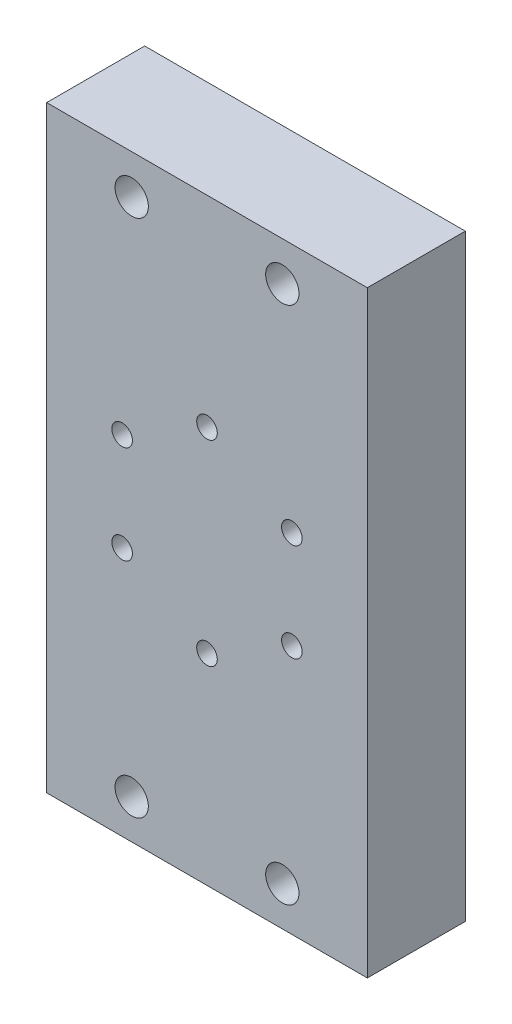
ISO-10303-21;
HEADER;
FILE_DESCRIPTION(('STEP AP214'),'2;1');
FILE_NAME('part.step','',(''),(''),'','','');
FILE_SCHEMA(('AUTOMOTIVE_DESIGN { 1 0 10303 214 1 1 1 1 }'));
ENDSEC;
DATA;
#1=APPLICATION_CONTEXT('core data for automotive mechanical design processes');
#2=APPLICATION_PROTOCOL_DEFINITION('international standard','automotive_design',2000,#1);
#3=PRODUCT_CONTEXT('',#1,'mechanical');
#4=PRODUCT('Part','Part','',(#3));
#5=PRODUCT_RELATED_PRODUCT_CATEGORY('part','',(#4));
#6=PRODUCT_DEFINITION_FORMATION('','',#4);
#7=PRODUCT_DEFINITION_CONTEXT('part definition',#1,'design');
#8=PRODUCT_DEFINITION('design','',#6,#7);
#9=PRODUCT_DEFINITION_SHAPE('','',#8);
#10=(LENGTH_UNIT() NAMED_UNIT(*) SI_UNIT(.MILLI.,.METRE.));
#11=(NAMED_UNIT(*) PLANE_ANGLE_UNIT() SI_UNIT($,.RADIAN.));
#12=(NAMED_UNIT(*) SI_UNIT($,.STERADIAN.) SOLID_ANGLE_UNIT());
#13=UNCERTAINTY_MEASURE_WITH_UNIT(LENGTH_MEASURE(1.E-05),#10,'distance_accuracy_value','');
#14=(GEOMETRIC_REPRESENTATION_CONTEXT(3) GLOBAL_UNCERTAINTY_ASSIGNED_CONTEXT((#13)) GLOBAL_UNIT_ASSIGNED_CONTEXT((#10,
#11,#12)) REPRESENTATION_CONTEXT('',''));
#15=CARTESIAN_POINT('',(0.,0.,0.));
#16=DIRECTION('',(0.,0.,1.));
#17=DIRECTION('',(1.,0.,0.));
#18=AXIS2_PLACEMENT_3D('',#15,#16,#17);
#19=CARTESIAN_POINT('',(0.,0.,20.));
#20=DIRECTION('',(0.,0.,-1.));
#21=DIRECTION('',(-1.,0.,0.));
#22=AXIS2_PLACEMENT_3D('',#19,#20,#21);
#23=PLANE('',#22);
#24=CARTESIAN_POINT('',(15.37,-53.,20.));
#25=DIRECTION('',(0.,0.,1.));
#26=DIRECTION('',(1.,0.,0.));
#27=AXIS2_PLACEMENT_3D('',#24,#25,#26);
#28=CIRCLE('',#27,3.4);
#29=CARTESIAN_POINT('',(18.77,-53.,20.));
#30=VERTEX_POINT('',#29);
#31=EDGE_CURVE('E156',#30,#30,#28,.T.);
#32=ORIENTED_EDGE('',*,*,#31,.F.);
#33=EDGE_LOOP('',(#32));
#34=FACE_BOUND('',#33,.T.);
#35=CARTESIAN_POINT('',(-17.3205080756888,-10.,20.));
#36=DIRECTION('',(0.,0.,1.));
#37=DIRECTION('',(1.,0.,0.));
#38=AXIS2_PLACEMENT_3D('',#35,#36,#37);
#39=CIRCLE('',#38,2.1);
#40=CARTESIAN_POINT('',(-15.2205080756888,-10.,20.));
#41=VERTEX_POINT('',#40);
#42=EDGE_CURVE('E132',#41,#41,#39,.T.);
#43=ORIENTED_EDGE('',*,*,#42,.F.);
#44=EDGE_LOOP('',(#43));
#45=FACE_BOUND('',#44,.T.);
#46=CARTESIAN_POINT('',(17.3205080756888,-10.,20.));
#47=DIRECTION('',(0.,0.,1.));
#48=DIRECTION('',(1.,0.,0.));
#49=AXIS2_PLACEMENT_3D('',#46,#47,#48);
#50=CIRCLE('',#49,2.1);
#51=CARTESIAN_POINT('',(19.4205080756888,-10.,20.));
#52=VERTEX_POINT('',#51);
#53=EDGE_CURVE('E120',#52,#52,#50,.T.);
#54=ORIENTED_EDGE('',*,*,#53,.F.);
#55=EDGE_LOOP('',(#54));
#56=FACE_BOUND('',#55,.T.);
#57=CARTESIAN_POINT('',(17.3205080756888,10.,20.));
#58=DIRECTION('',(0.,0.,1.));
#59=DIRECTION('',(1.,0.,0.));
#60=AXIS2_PLACEMENT_3D('',#57,#58,#59);
#61=CIRCLE('',#60,2.1);
#62=CARTESIAN_POINT('',(19.4205080756888,10.,20.));
#63=VERTEX_POINT('',#62);
#64=EDGE_CURVE('E114',#63,#63,#61,.T.);
#65=ORIENTED_EDGE('',*,*,#64,.F.);
#66=EDGE_LOOP('',(#65));
#67=FACE_BOUND('',#66,.T.);
#68=DIRECTION('',(0.,1.,0.));
#69=VECTOR('',#68,1.);
#70=CARTESIAN_POINT('',(32.72,-61.,20.));
#71=LINE('',#70,#69);
#72=CARTESIAN_POINT('',(32.72,-61.,20.));
#73=VERTEX_POINT('',#72);
#74=CARTESIAN_POINT('',(32.72,61.,20.));
#75=VERTEX_POINT('',#74);
#76=EDGE_CURVE('E86',#73,#75,#71,.T.);
#77=ORIENTED_EDGE('',*,*,#76,.T.);
#78=DIRECTION('',(-1.,0.,0.));
#79=VECTOR('',#78,1.);
#80=CARTESIAN_POINT('',(-32.72,61.,20.));
#81=LINE('',#80,#79);
#82=CARTESIAN_POINT('',(-32.72,61.,20.));
#83=VERTEX_POINT('',#82);
#84=EDGE_CURVE('E81',#75,#83,#81,.T.);
#85=ORIENTED_EDGE('',*,*,#84,.T.);
#86=DIRECTION('',(0.,-1.,0.));
#87=VECTOR('',#86,1.);
#88=CARTESIAN_POINT('',(-32.72,-61.,20.));
#89=LINE('',#88,#87);
#90=CARTESIAN_POINT('',(-32.72,-61.,20.));
#91=VERTEX_POINT('',#90);
#92=EDGE_CURVE('E84',#83,#91,#89,.T.);
#93=ORIENTED_EDGE('',*,*,#92,.T.);
#94=DIRECTION('',(1.,0.,0.));
#95=VECTOR('',#94,1.);
#96=CARTESIAN_POINT('',(-32.72,-61.,20.));
#97=LINE('',#96,#95);
#98=EDGE_CURVE('E51',#91,#73,#97,.T.);
#99=ORIENTED_EDGE('',*,*,#98,.T.);
#100=EDGE_LOOP('',(#77,#85,#93,#99));
#101=FACE_BOUND('',#100,.T.);
#102=CARTESIAN_POINT('',(0.,-20.,20.));
#103=DIRECTION('',(0.,0.,1.));
#104=DIRECTION('',(1.,0.,0.));
#105=AXIS2_PLACEMENT_3D('',#102,#103,#104);
#106=CIRCLE('',#105,2.1);
#107=CARTESIAN_POINT('',(2.1,-20.,20.));
#108=VERTEX_POINT('',#107);
#109=EDGE_CURVE('E126',#108,#108,#106,.T.);
#110=ORIENTED_EDGE('',*,*,#109,.F.);
#111=EDGE_LOOP('',(#110));
#112=FACE_BOUND('',#111,.T.);
#113=CARTESIAN_POINT('',(-17.3205080756888,10.,20.));
#114=DIRECTION('',(0.,0.,1.));
#115=DIRECTION('',(1.,0.,0.));
#116=AXIS2_PLACEMENT_3D('',#113,#114,#115);
#117=CIRCLE('',#116,2.1);
#118=CARTESIAN_POINT('',(-15.2205080756888,10.,20.));
#119=VERTEX_POINT('',#118);
#120=EDGE_CURVE('E138',#119,#119,#117,.T.);
#121=ORIENTED_EDGE('',*,*,#120,.F.);
#122=EDGE_LOOP('',(#121));
#123=FACE_BOUND('',#122,.T.);
#124=CARTESIAN_POINT('',(0.,20.,20.));
#125=DIRECTION('',(0.,0.,1.));
#126=DIRECTION('',(1.,0.,0.));
#127=AXIS2_PLACEMENT_3D('',#124,#125,#126);
#128=CIRCLE('',#127,2.1);
#129=CARTESIAN_POINT('',(2.1,20.,20.));
#130=VERTEX_POINT('',#129);
#131=EDGE_CURVE('E144',#130,#130,#128,.T.);
#132=ORIENTED_EDGE('',*,*,#131,.F.);
#133=EDGE_LOOP('',(#132));
#134=FACE_BOUND('',#133,.T.);
#135=CARTESIAN_POINT('',(-15.37,-53.,20.));
#136=DIRECTION('',(0.,0.,1.));
#137=DIRECTION('',(1.,0.,0.));
#138=AXIS2_PLACEMENT_3D('',#135,#136,#137);
#139=CIRCLE('',#138,3.4);
#140=CARTESIAN_POINT('',(-11.97,-53.,20.));
#141=VERTEX_POINT('',#140);
#142=EDGE_CURVE('E150',#141,#141,#139,.T.);
#143=ORIENTED_EDGE('',*,*,#142,.F.);
#144=EDGE_LOOP('',(#143));
#145=FACE_BOUND('',#144,.T.);
#146=CARTESIAN_POINT('',(15.37,53.,20.));
#147=DIRECTION('',(0.,0.,1.));
#148=DIRECTION('',(1.,0.,0.));
#149=AXIS2_PLACEMENT_3D('',#146,#147,#148);
#150=CIRCLE('',#149,3.4);
#151=CARTESIAN_POINT('',(18.77,53.,20.));
#152=VERTEX_POINT('',#151);
#153=EDGE_CURVE('E162',#152,#152,#150,.T.);
#154=ORIENTED_EDGE('',*,*,#153,.F.);
#155=EDGE_LOOP('',(#154));
#156=FACE_BOUND('',#155,.T.);
#157=CARTESIAN_POINT('',(-15.37,53.,20.));
#158=DIRECTION('',(0.,0.,1.));
#159=DIRECTION('',(1.,0.,0.));
#160=AXIS2_PLACEMENT_3D('',#157,#158,#159);
#161=CIRCLE('',#160,3.4);
#162=CARTESIAN_POINT('',(-11.97,53.,20.));
#163=VERTEX_POINT('',#162);
#164=EDGE_CURVE('E168',#163,#163,#161,.T.);
#165=ORIENTED_EDGE('',*,*,#164,.F.);
#166=EDGE_LOOP('',(#165));
#167=FACE_BOUND('',#166,.T.);
#168=ADVANCED_FACE('F34',(#34,#45,#56,#67,#101,#112,#123,#134,#145,#156,#167),#23,.F.);
#169=CARTESIAN_POINT('',(32.72,-61.,20.));
#170=DIRECTION('',(-1.,0.,0.));
#171=DIRECTION('',(0.,0.,1.));
#172=AXIS2_PLACEMENT_3D('',#169,#170,#171);
#173=PLANE('',#172);
#174=DIRECTION('',(0.,1.,0.));
#175=VECTOR('',#174,1.);
#176=CARTESIAN_POINT('',(32.72,-61.,0.));
#177=LINE('',#176,#175);
#178=CARTESIAN_POINT('',(32.72,-61.,0.));
#179=VERTEX_POINT('',#178);
#180=CARTESIAN_POINT('',(32.72,61.,0.));
#181=VERTEX_POINT('',#180);
#182=EDGE_CURVE('E98',#179,#181,#177,.T.);
#183=ORIENTED_EDGE('',*,*,#182,.T.);
#184=DIRECTION('',(0.,0.,-1.));
#185=VECTOR('',#184,1.);
#186=CARTESIAN_POINT('',(32.72,61.,20.));
#187=LINE('',#186,#185);
#188=EDGE_CURVE('E11',#75,#181,#187,.T.);
#189=ORIENTED_EDGE('',*,*,#188,.F.);
#190=ORIENTED_EDGE('',*,*,#76,.F.);
#191=DIRECTION('',(0.,0.,-1.));
#192=VECTOR('',#191,1.);
#193=CARTESIAN_POINT('',(32.72,-61.,20.));
#194=LINE('',#193,#192);
#195=EDGE_CURVE('E94',#73,#179,#194,.T.);
#196=ORIENTED_EDGE('',*,*,#195,.T.);
#197=EDGE_LOOP('',(#183,#189,#190,#196));
#198=FACE_BOUND('',#197,.T.);
#199=ADVANCED_FACE('F36',(#198),#173,.F.);
#200=CARTESIAN_POINT('',(-32.72,61.,20.));
#201=DIRECTION('',(0.,-1.,0.));
#202=DIRECTION('',(0.,0.,-1.));
#203=AXIS2_PLACEMENT_3D('',#200,#201,#202);
#204=PLANE('',#203);
#205=DIRECTION('',(-1.,0.,0.));
#206=VECTOR('',#205,1.);
#207=CARTESIAN_POINT('',(-32.72,61.,0.));
#208=LINE('',#207,#206);
#209=CARTESIAN_POINT('',(-32.72,61.,0.));
#210=VERTEX_POINT('',#209);
#211=EDGE_CURVE('E90',#181,#210,#208,.T.);
#212=ORIENTED_EDGE('',*,*,#211,.T.);
#213=DIRECTION('',(0.,0.,-1.));
#214=VECTOR('',#213,1.);
#215=CARTESIAN_POINT('',(-32.72,61.,20.));
#216=LINE('',#215,#214);
#217=EDGE_CURVE('E43',#83,#210,#216,.T.);
#218=ORIENTED_EDGE('',*,*,#217,.F.);
#219=ORIENTED_EDGE('',*,*,#84,.F.);
#220=ORIENTED_EDGE('',*,*,#188,.T.);
#221=EDGE_LOOP('',(#212,#218,#219,#220));
#222=FACE_BOUND('',#221,.T.);
#223=ADVANCED_FACE('F89',(#222),#204,.F.);
#224=CARTESIAN_POINT('',(-32.72,-61.,20.));
#225=DIRECTION('',(1.,0.,0.));
#226=DIRECTION('',(0.,0.,-1.));
#227=AXIS2_PLACEMENT_3D('',#224,#225,#226);
#228=PLANE('',#227);
#229=DIRECTION('',(0.,-1.,0.));
#230=VECTOR('',#229,1.);
#231=CARTESIAN_POINT('',(-32.72,-61.,0.));
#232=LINE('',#231,#230);
#233=CARTESIAN_POINT('',(-32.72,-61.,0.));
#234=VERTEX_POINT('',#233);
#235=EDGE_CURVE('E68',#210,#234,#232,.T.);
#236=ORIENTED_EDGE('',*,*,#235,.T.);
#237=DIRECTION('',(0.,0.,-1.));
#238=VECTOR('',#237,1.);
#239=CARTESIAN_POINT('',(-32.72,-61.,20.));
#240=LINE('',#239,#238);
#241=EDGE_CURVE('E91',#91,#234,#240,.T.);
#242=ORIENTED_EDGE('',*,*,#241,.F.);
#243=ORIENTED_EDGE('',*,*,#92,.F.);
#244=ORIENTED_EDGE('',*,*,#217,.T.);
#245=EDGE_LOOP('',(#236,#242,#243,#244));
#246=FACE_BOUND('',#245,.T.);
#247=ADVANCED_FACE('F92',(#246),#228,.F.);
#248=CARTESIAN_POINT('',(-32.72,-61.,20.));
#249=DIRECTION('',(0.,1.,0.));
#250=DIRECTION('',(0.,0.,1.));
#251=AXIS2_PLACEMENT_3D('',#248,#249,#250);
#252=PLANE('',#251);
#253=DIRECTION('',(1.,0.,0.));
#254=VECTOR('',#253,1.);
#255=CARTESIAN_POINT('',(-32.72,-61.,0.));
#256=LINE('',#255,#254);
#257=EDGE_CURVE('E74',#234,#179,#256,.T.);
#258=ORIENTED_EDGE('',*,*,#257,.T.);
#259=ORIENTED_EDGE('',*,*,#195,.F.);
#260=ORIENTED_EDGE('',*,*,#98,.F.);
#261=ORIENTED_EDGE('',*,*,#241,.T.);
#262=EDGE_LOOP('',(#258,#259,#260,#261));
#263=FACE_BOUND('',#262,.T.);
#264=ADVANCED_FACE('F106',(#263),#252,.F.);
#265=CARTESIAN_POINT('',(0.,0.,0.));
#266=DIRECTION('',(0.,0.,-1.));
#267=DIRECTION('',(-1.,0.,0.));
#268=AXIS2_PLACEMENT_3D('',#265,#266,#267);
#269=PLANE('',#268);
#270=CARTESIAN_POINT('',(-15.37,53.,0.));
#271=DIRECTION('',(0.,0.,-1.));
#272=DIRECTION('',(-1.,0.,0.));
#273=AXIS2_PLACEMENT_3D('',#270,#271,#272);
#274=CIRCLE('',#273,3.4);
#275=CARTESIAN_POINT('',(-18.77,53.,0.));
#276=VERTEX_POINT('',#275);
#277=EDGE_CURVE('E165',#276,#276,#274,.T.);
#278=ORIENTED_EDGE('',*,*,#277,.F.);
#279=EDGE_LOOP('',(#278));
#280=FACE_BOUND('',#279,.T.);
#281=CARTESIAN_POINT('',(15.37,53.,0.));
#282=DIRECTION('',(0.,0.,-1.));
#283=DIRECTION('',(-1.,0.,0.));
#284=AXIS2_PLACEMENT_3D('',#281,#282,#283);
#285=CIRCLE('',#284,3.4);
#286=CARTESIAN_POINT('',(11.97,53.,0.));
#287=VERTEX_POINT('',#286);
#288=EDGE_CURVE('E159',#287,#287,#285,.T.);
#289=ORIENTED_EDGE('',*,*,#288,.F.);
#290=EDGE_LOOP('',(#289));
#291=FACE_BOUND('',#290,.T.);
#292=CARTESIAN_POINT('',(15.37,-53.,0.));
#293=DIRECTION('',(0.,0.,-1.));
#294=DIRECTION('',(-1.,0.,0.));
#295=AXIS2_PLACEMENT_3D('',#292,#293,#294);
#296=CIRCLE('',#295,3.4);
#297=CARTESIAN_POINT('',(11.97,-53.,0.));
#298=VERTEX_POINT('',#297);
#299=EDGE_CURVE('E153',#298,#298,#296,.T.);
#300=ORIENTED_EDGE('',*,*,#299,.F.);
#301=EDGE_LOOP('',(#300));
#302=FACE_BOUND('',#301,.T.);
#303=CARTESIAN_POINT('',(-15.37,-53.,0.));
#304=DIRECTION('',(0.,0.,-1.));
#305=DIRECTION('',(-1.,0.,0.));
#306=AXIS2_PLACEMENT_3D('',#303,#304,#305);
#307=CIRCLE('',#306,3.4);
#308=CARTESIAN_POINT('',(-18.77,-53.,0.));
#309=VERTEX_POINT('',#308);
#310=EDGE_CURVE('E147',#309,#309,#307,.T.);
#311=ORIENTED_EDGE('',*,*,#310,.F.);
#312=EDGE_LOOP('',(#311));
#313=FACE_BOUND('',#312,.T.);
#314=CARTESIAN_POINT('',(0.,20.,0.));
#315=DIRECTION('',(0.,0.,-1.));
#316=DIRECTION('',(-1.,0.,0.));
#317=AXIS2_PLACEMENT_3D('',#314,#315,#316);
#318=CIRCLE('',#317,2.1);
#319=CARTESIAN_POINT('',(-2.1,20.,0.));
#320=VERTEX_POINT('',#319);
#321=EDGE_CURVE('E141',#320,#320,#318,.T.);
#322=ORIENTED_EDGE('',*,*,#321,.F.);
#323=EDGE_LOOP('',(#322));
#324=FACE_BOUND('',#323,.T.);
#325=CARTESIAN_POINT('',(-17.3205080756888,10.,0.));
#326=DIRECTION('',(0.,0.,-1.));
#327=DIRECTION('',(-1.,0.,0.));
#328=AXIS2_PLACEMENT_3D('',#325,#326,#327);
#329=CIRCLE('',#328,2.1);
#330=CARTESIAN_POINT('',(-19.4205080756888,10.,0.));
#331=VERTEX_POINT('',#330);
#332=EDGE_CURVE('E135',#331,#331,#329,.T.);
#333=ORIENTED_EDGE('',*,*,#332,.F.);
#334=EDGE_LOOP('',(#333));
#335=FACE_BOUND('',#334,.T.);
#336=CARTESIAN_POINT('',(-17.3205080756888,-10.,0.));
#337=DIRECTION('',(0.,0.,-1.));
#338=DIRECTION('',(-1.,0.,0.));
#339=AXIS2_PLACEMENT_3D('',#336,#337,#338);
#340=CIRCLE('',#339,2.1);
#341=CARTESIAN_POINT('',(-19.4205080756888,-10.,0.));
#342=VERTEX_POINT('',#341);
#343=EDGE_CURVE('E129',#342,#342,#340,.T.);
#344=ORIENTED_EDGE('',*,*,#343,.F.);
#345=EDGE_LOOP('',(#344));
#346=FACE_BOUND('',#345,.T.);
#347=CARTESIAN_POINT('',(0.,-20.,0.));
#348=DIRECTION('',(0.,0.,-1.));
#349=DIRECTION('',(-1.,0.,0.));
#350=AXIS2_PLACEMENT_3D('',#347,#348,#349);
#351=CIRCLE('',#350,2.1);
#352=CARTESIAN_POINT('',(-2.1,-20.,0.));
#353=VERTEX_POINT('',#352);
#354=EDGE_CURVE('E123',#353,#353,#351,.T.);
#355=ORIENTED_EDGE('',*,*,#354,.F.);
#356=EDGE_LOOP('',(#355));
#357=FACE_BOUND('',#356,.T.);
#358=CARTESIAN_POINT('',(17.3205080756888,-10.,0.));
#359=DIRECTION('',(0.,0.,-1.));
#360=DIRECTION('',(-1.,0.,0.));
#361=AXIS2_PLACEMENT_3D('',#358,#359,#360);
#362=CIRCLE('',#361,2.1);
#363=CARTESIAN_POINT('',(15.2205080756888,-10.,0.));
#364=VERTEX_POINT('',#363);
#365=EDGE_CURVE('E117',#364,#364,#362,.T.);
#366=ORIENTED_EDGE('',*,*,#365,.F.);
#367=EDGE_LOOP('',(#366));
#368=FACE_BOUND('',#367,.T.);
#369=CARTESIAN_POINT('',(17.3205080756888,10.,0.));
#370=DIRECTION('',(0.,0.,-1.));
#371=DIRECTION('',(-1.,0.,0.));
#372=AXIS2_PLACEMENT_3D('',#369,#370,#371);
#373=CIRCLE('',#372,2.1);
#374=CARTESIAN_POINT('',(15.2205080756888,10.,0.));
#375=VERTEX_POINT('',#374);
#376=EDGE_CURVE('E101',#375,#375,#373,.T.);
#377=ORIENTED_EDGE('',*,*,#376,.F.);
#378=EDGE_LOOP('',(#377));
#379=FACE_BOUND('',#378,.T.);
#380=ORIENTED_EDGE('',*,*,#182,.F.);
#381=ORIENTED_EDGE('',*,*,#257,.F.);
#382=ORIENTED_EDGE('',*,*,#235,.F.);
#383=ORIENTED_EDGE('',*,*,#211,.F.);
#384=EDGE_LOOP('',(#380,#381,#382,#383));
#385=FACE_BOUND('',#384,.T.);
#386=ADVANCED_FACE('F109',(#280,#291,#302,#313,#324,#335,#346,#357,#368,#379,#385),#269,.T.);
#387=CARTESIAN_POINT('',(17.3205080756888,10.,20.));
#388=DIRECTION('',(0.,0.,1.));
#389=DIRECTION('',(1.,0.,0.));
#390=AXIS2_PLACEMENT_3D('',#387,#388,#389);
#391=CYLINDRICAL_SURFACE('',#390,2.1);
#392=ORIENTED_EDGE('',*,*,#64,.T.);
#393=EDGE_LOOP('',(#392));
#394=FACE_BOUND('',#393,.T.);
#395=ORIENTED_EDGE('',*,*,#376,.T.);
#396=EDGE_LOOP('',(#395));
#397=FACE_BOUND('',#396,.T.);
#398=ADVANCED_FACE('F185',(#394,#397),#391,.F.);
#399=CARTESIAN_POINT('',(17.3205080756888,-10.,20.));
#400=DIRECTION('',(0.,0.,1.));
#401=DIRECTION('',(1.,0.,0.));
#402=AXIS2_PLACEMENT_3D('',#399,#400,#401);
#403=CYLINDRICAL_SURFACE('',#402,2.1);
#404=ORIENTED_EDGE('',*,*,#53,.T.);
#405=EDGE_LOOP('',(#404));
#406=FACE_BOUND('',#405,.T.);
#407=ORIENTED_EDGE('',*,*,#365,.T.);
#408=EDGE_LOOP('',(#407));
#409=FACE_BOUND('',#408,.T.);
#410=ADVANCED_FACE('F217',(#406,#409),#403,.F.);
#411=CARTESIAN_POINT('',(0.,-20.,20.));
#412=DIRECTION('',(0.,0.,1.));
#413=DIRECTION('',(1.,0.,0.));
#414=AXIS2_PLACEMENT_3D('',#411,#412,#413);
#415=CYLINDRICAL_SURFACE('',#414,2.1);
#416=ORIENTED_EDGE('',*,*,#109,.T.);
#417=EDGE_LOOP('',(#416));
#418=FACE_BOUND('',#417,.T.);
#419=ORIENTED_EDGE('',*,*,#354,.T.);
#420=EDGE_LOOP('',(#419));
#421=FACE_BOUND('',#420,.T.);
#422=ADVANCED_FACE('F224',(#418,#421),#415,.F.);
#423=CARTESIAN_POINT('',(-17.3205080756888,-10.,20.));
#424=DIRECTION('',(0.,0.,1.));
#425=DIRECTION('',(1.,0.,0.));
#426=AXIS2_PLACEMENT_3D('',#423,#424,#425);
#427=CYLINDRICAL_SURFACE('',#426,2.1);
#428=ORIENTED_EDGE('',*,*,#42,.T.);
#429=EDGE_LOOP('',(#428));
#430=FACE_BOUND('',#429,.T.);
#431=ORIENTED_EDGE('',*,*,#343,.T.);
#432=EDGE_LOOP('',(#431));
#433=FACE_BOUND('',#432,.T.);
#434=ADVANCED_FACE('F231',(#430,#433),#427,.F.);
#435=CARTESIAN_POINT('',(-17.3205080756888,10.,20.));
#436=DIRECTION('',(0.,0.,1.));
#437=DIRECTION('',(1.,0.,0.));
#438=AXIS2_PLACEMENT_3D('',#435,#436,#437);
#439=CYLINDRICAL_SURFACE('',#438,2.1);
#440=ORIENTED_EDGE('',*,*,#120,.T.);
#441=EDGE_LOOP('',(#440));
#442=FACE_BOUND('',#441,.T.);
#443=ORIENTED_EDGE('',*,*,#332,.T.);
#444=EDGE_LOOP('',(#443));
#445=FACE_BOUND('',#444,.T.);
#446=ADVANCED_FACE('F239',(#442,#445),#439,.F.);
#447=CARTESIAN_POINT('',(0.,20.,20.));
#448=DIRECTION('',(0.,0.,1.));
#449=DIRECTION('',(1.,0.,0.));
#450=AXIS2_PLACEMENT_3D('',#447,#448,#449);
#451=CYLINDRICAL_SURFACE('',#450,2.1);
#452=ORIENTED_EDGE('',*,*,#131,.T.);
#453=EDGE_LOOP('',(#452));
#454=FACE_BOUND('',#453,.T.);
#455=ORIENTED_EDGE('',*,*,#321,.T.);
#456=EDGE_LOOP('',(#455));
#457=FACE_BOUND('',#456,.T.);
#458=ADVANCED_FACE('F247',(#454,#457),#451,.F.);
#459=CARTESIAN_POINT('',(-15.37,-53.,20.));
#460=DIRECTION('',(0.,0.,1.));
#461=DIRECTION('',(1.,0.,0.));
#462=AXIS2_PLACEMENT_3D('',#459,#460,#461);
#463=CYLINDRICAL_SURFACE('',#462,3.4);
#464=ORIENTED_EDGE('',*,*,#142,.T.);
#465=EDGE_LOOP('',(#464));
#466=FACE_BOUND('',#465,.T.);
#467=ORIENTED_EDGE('',*,*,#310,.T.);
#468=EDGE_LOOP('',(#467));
#469=FACE_BOUND('',#468,.T.);
#470=ADVANCED_FACE('F255',(#466,#469),#463,.F.);
#471=CARTESIAN_POINT('',(15.37,-53.,20.));
#472=DIRECTION('',(0.,0.,1.));
#473=DIRECTION('',(1.,0.,0.));
#474=AXIS2_PLACEMENT_3D('',#471,#472,#473);
#475=CYLINDRICAL_SURFACE('',#474,3.4);
#476=ORIENTED_EDGE('',*,*,#31,.T.);
#477=EDGE_LOOP('',(#476));
#478=FACE_BOUND('',#477,.T.);
#479=ORIENTED_EDGE('',*,*,#299,.T.);
#480=EDGE_LOOP('',(#479));
#481=FACE_BOUND('',#480,.T.);
#482=ADVANCED_FACE('F262',(#478,#481),#475,.F.);
#483=CARTESIAN_POINT('',(15.37,53.,20.));
#484=DIRECTION('',(0.,0.,1.));
#485=DIRECTION('',(1.,0.,0.));
#486=AXIS2_PLACEMENT_3D('',#483,#484,#485);
#487=CYLINDRICAL_SURFACE('',#486,3.4);
#488=ORIENTED_EDGE('',*,*,#153,.T.);
#489=EDGE_LOOP('',(#488));
#490=FACE_BOUND('',#489,.T.);
#491=ORIENTED_EDGE('',*,*,#288,.T.);
#492=EDGE_LOOP('',(#491));
#493=FACE_BOUND('',#492,.T.);
#494=ADVANCED_FACE('F270',(#490,#493),#487,.F.);
#495=CARTESIAN_POINT('',(-15.37,53.,20.));
#496=DIRECTION('',(0.,0.,1.));
#497=DIRECTION('',(1.,0.,0.));
#498=AXIS2_PLACEMENT_3D('',#495,#496,#497);
#499=CYLINDRICAL_SURFACE('',#498,3.4);
#500=ORIENTED_EDGE('',*,*,#164,.T.);
#501=EDGE_LOOP('',(#500));
#502=FACE_BOUND('',#501,.T.);
#503=ORIENTED_EDGE('',*,*,#277,.T.);
#504=EDGE_LOOP('',(#503));
#505=FACE_BOUND('',#504,.T.);
#506=ADVANCED_FACE('F172',(#502,#505),#499,.F.);
#507=CLOSED_SHELL('',(#168,#199,#223,#247,#264,#386,#398,#410,#422,#434,#446,#458,#470,#482,
#494,#506));
#508=MANIFOLD_SOLID_BREP('B2',#507);
#509=ADVANCED_BREP_SHAPE_REPRESENTATION('',(#18,#508),#14);
#510=SHAPE_DEFINITION_REPRESENTATION(#9,#509);
ENDSEC;
END-ISO-10303-21;
